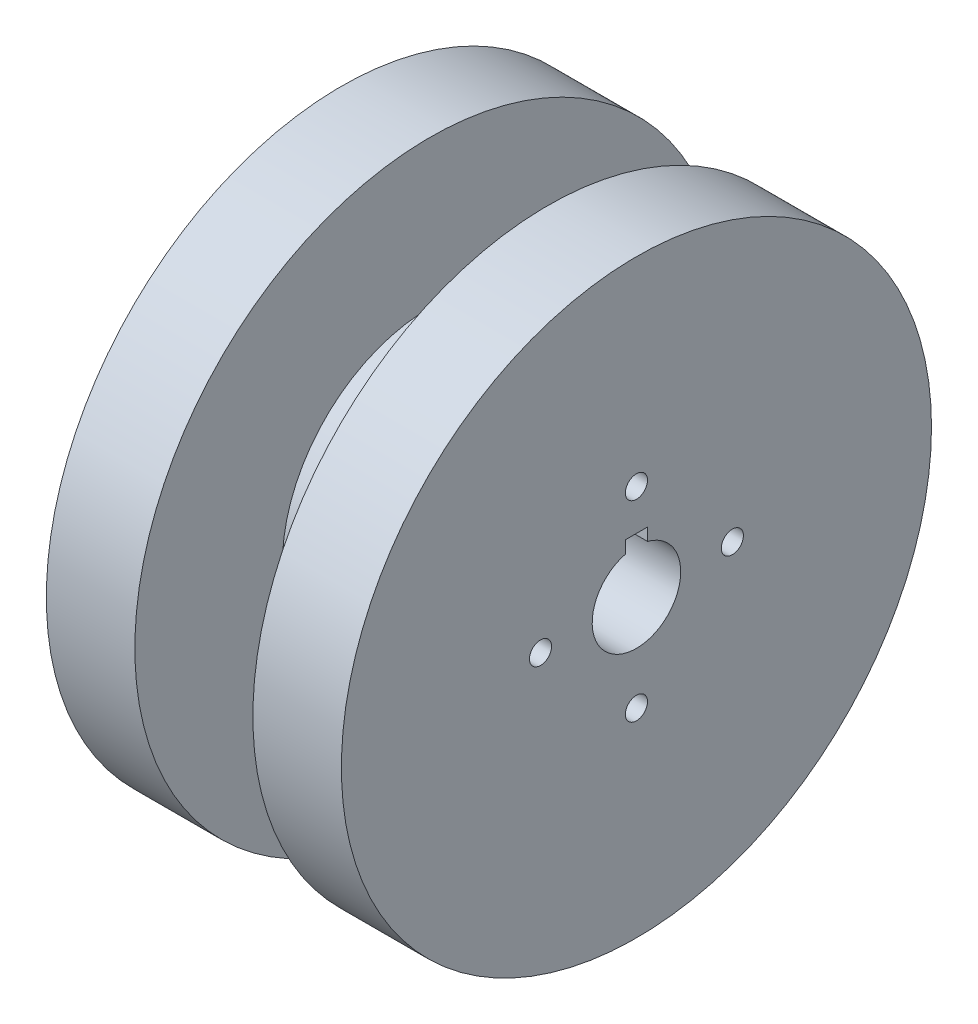
ISO-10303-21;
HEADER;
FILE_DESCRIPTION(('STEP AP214'),'2;1');
FILE_NAME('part.step','',(''),(''),'','','');
FILE_SCHEMA(('AUTOMOTIVE_DESIGN { 1 0 10303 214 1 1 1 1 }'));
ENDSEC;
DATA;
#1=APPLICATION_CONTEXT('core data for automotive mechanical design processes');
#2=APPLICATION_PROTOCOL_DEFINITION('international standard','automotive_design',2000,#1);
#3=PRODUCT_CONTEXT('',#1,'mechanical');
#4=PRODUCT('Part','Part','',(#3));
#5=PRODUCT_RELATED_PRODUCT_CATEGORY('part','',(#4));
#6=PRODUCT_DEFINITION_FORMATION('','',#4);
#7=PRODUCT_DEFINITION_CONTEXT('part definition',#1,'design');
#8=PRODUCT_DEFINITION('design','',#6,#7);
#9=PRODUCT_DEFINITION_SHAPE('','',#8);
#10=(LENGTH_UNIT() NAMED_UNIT(*) SI_UNIT(.MILLI.,.METRE.));
#11=(NAMED_UNIT(*) PLANE_ANGLE_UNIT() SI_UNIT($,.RADIAN.));
#12=(NAMED_UNIT(*) SI_UNIT($,.STERADIAN.) SOLID_ANGLE_UNIT());
#13=UNCERTAINTY_MEASURE_WITH_UNIT(LENGTH_MEASURE(1.E-05),#10,'distance_accuracy_value','');
#14=(GEOMETRIC_REPRESENTATION_CONTEXT(3) GLOBAL_UNCERTAINTY_ASSIGNED_CONTEXT((#13)) GLOBAL_UNIT_ASSIGNED_CONTEXT((#10,
#11,#12)) REPRESENTATION_CONTEXT('',''));
#15=CARTESIAN_POINT('',(0.,0.,0.));
#16=DIRECTION('',(0.,0.,1.));
#17=DIRECTION('',(1.,0.,0.));
#18=AXIS2_PLACEMENT_3D('',#15,#16,#17);
#19=CARTESIAN_POINT('',(40.,0.,0.));
#20=DIRECTION('',(-1.,0.,0.));
#21=DIRECTION('',(0.,0.,1.));
#22=AXIS2_PLACEMENT_3D('',#19,#20,#21);
#23=CYLINDRICAL_SURFACE('',#22,6.);
#24=CARTESIAN_POINT('',(4.,0.,0.));
#25=DIRECTION('',(-1.,0.,0.));
#26=DIRECTION('',(0.,0.,1.));
#27=AXIS2_PLACEMENT_3D('',#24,#25,#26);
#28=CIRCLE('',#27,6.);
#29=CARTESIAN_POINT('',(4.,5.80947501931113,1.5));
#30=VERTEX_POINT('',#29);
#31=CARTESIAN_POINT('',(4.,5.80947501931113,-1.5));
#32=VERTEX_POINT('',#31);
#33=EDGE_CURVE('E296',#30,#32,#28,.F.);
#34=ORIENTED_EDGE('',*,*,#33,.F.);
#35=DIRECTION('',(-1.,0.,0.));
#36=VECTOR('',#35,1.);
#37=CARTESIAN_POINT('',(40.,5.80947501931113,1.5));
#38=LINE('',#37,#36);
#39=CARTESIAN_POINT('',(40.,5.80947501931113,1.5));
#40=VERTEX_POINT('',#39);
#41=EDGE_CURVE('E321',#40,#30,#38,.T.);
#42=ORIENTED_EDGE('',*,*,#41,.F.);
#43=CARTESIAN_POINT('',(40.,0.,0.));
#44=DIRECTION('',(-1.,0.,0.));
#45=DIRECTION('',(0.,0.,1.));
#46=AXIS2_PLACEMENT_3D('',#43,#44,#45);
#47=CIRCLE('',#46,6.);
#48=CARTESIAN_POINT('',(40.,5.80947501931113,-1.5));
#49=VERTEX_POINT('',#48);
#50=EDGE_CURVE('E302',#49,#40,#47,.T.);
#51=ORIENTED_EDGE('',*,*,#50,.F.);
#52=DIRECTION('',(-1.,0.,0.));
#53=VECTOR('',#52,1.);
#54=CARTESIAN_POINT('',(40.,5.80947501931113,-1.5));
#55=LINE('',#54,#53);
#56=EDGE_CURVE('E322',#49,#32,#55,.T.);
#57=ORIENTED_EDGE('',*,*,#56,.T.);
#58=EDGE_LOOP('',(#34,#42,#51,#57));
#59=FACE_BOUND('',#58,.T.);
#60=ADVANCED_FACE('F37',(#59),#23,.F.);
#61=CARTESIAN_POINT('',(40.,0.,-1.5));
#62=DIRECTION('',(0.,0.,-1.));
#63=DIRECTION('',(-1.,0.,0.));
#64=AXIS2_PLACEMENT_3D('',#61,#62,#63);
#65=PLANE('',#64);
#66=DIRECTION('',(0.,1.,0.));
#67=VECTOR('',#66,1.);
#68=CARTESIAN_POINT('',(4.,0.,-1.5));
#69=LINE('',#68,#67);
#70=CARTESIAN_POINT('',(4.,7.5,-1.5));
#71=VERTEX_POINT('',#70);
#72=EDGE_CURVE('E294',#32,#71,#69,.T.);
#73=ORIENTED_EDGE('',*,*,#72,.F.);
#74=ORIENTED_EDGE('',*,*,#56,.F.);
#75=DIRECTION('',(0.,-1.,0.));
#76=VECTOR('',#75,1.);
#77=CARTESIAN_POINT('',(40.,0.,-1.5));
#78=LINE('',#77,#76);
#79=CARTESIAN_POINT('',(40.,7.5,-1.5));
#80=VERTEX_POINT('',#79);
#81=EDGE_CURVE('E318',#80,#49,#78,.T.);
#82=ORIENTED_EDGE('',*,*,#81,.F.);
#83=DIRECTION('',(-1.,0.,0.));
#84=VECTOR('',#83,1.);
#85=CARTESIAN_POINT('',(40.,7.5,-1.5));
#86=LINE('',#85,#84);
#87=EDGE_CURVE('E326',#80,#71,#86,.T.);
#88=ORIENTED_EDGE('',*,*,#87,.T.);
#89=EDGE_LOOP('',(#73,#74,#82,#88));
#90=FACE_BOUND('',#89,.T.);
#91=ADVANCED_FACE('F411',(#90),#65,.F.);
#92=CARTESIAN_POINT('',(40.,7.5,0.));
#93=DIRECTION('',(0.,-1.,0.));
#94=DIRECTION('',(0.,0.,-1.));
#95=AXIS2_PLACEMENT_3D('',#92,#93,#94);
#96=PLANE('',#95);
#97=DIRECTION('',(-1.,0.,0.));
#98=VECTOR('',#97,1.);
#99=CARTESIAN_POINT('',(40.,7.5,1.5));
#100=LINE('',#99,#98);
#101=CARTESIAN_POINT('',(40.,7.5,1.5));
#102=VERTEX_POINT('',#101);
#103=CARTESIAN_POINT('',(4.,7.5,1.5));
#104=VERTEX_POINT('',#103);
#105=EDGE_CURVE('E329',#102,#104,#100,.T.);
#106=ORIENTED_EDGE('',*,*,#105,.T.);
#107=DIRECTION('',(0.,0.,-1.));
#108=VECTOR('',#107,1.);
#109=CARTESIAN_POINT('',(4.,7.5,0.));
#110=LINE('',#109,#108);
#111=EDGE_CURVE('E291',#104,#71,#110,.T.);
#112=ORIENTED_EDGE('',*,*,#111,.T.);
#113=ORIENTED_EDGE('',*,*,#87,.F.);
#114=DIRECTION('',(0.,0.,1.));
#115=VECTOR('',#114,1.);
#116=CARTESIAN_POINT('',(40.,7.5,0.));
#117=LINE('',#116,#115);
#118=EDGE_CURVE('E315',#80,#102,#117,.T.);
#119=ORIENTED_EDGE('',*,*,#118,.T.);
#120=EDGE_LOOP('',(#106,#112,#113,#119));
#121=FACE_BOUND('',#120,.T.);
#122=ADVANCED_FACE('F417',(#121),#96,.T.);
#123=CARTESIAN_POINT('',(40.,0.,1.5));
#124=DIRECTION('',(0.,0.,-1.));
#125=DIRECTION('',(-1.,0.,0.));
#126=AXIS2_PLACEMENT_3D('',#123,#124,#125);
#127=PLANE('',#126);
#128=ORIENTED_EDGE('',*,*,#41,.T.);
#129=DIRECTION('',(0.,1.,0.));
#130=VECTOR('',#129,1.);
#131=CARTESIAN_POINT('',(4.,0.,1.5));
#132=LINE('',#131,#130);
#133=EDGE_CURVE('E288',#30,#104,#132,.T.);
#134=ORIENTED_EDGE('',*,*,#133,.T.);
#135=ORIENTED_EDGE('',*,*,#105,.F.);
#136=DIRECTION('',(0.,-1.,0.));
#137=VECTOR('',#136,1.);
#138=CARTESIAN_POINT('',(40.,0.,1.5));
#139=LINE('',#138,#137);
#140=EDGE_CURVE('E313',#102,#40,#139,.T.);
#141=ORIENTED_EDGE('',*,*,#140,.T.);
#142=EDGE_LOOP('',(#128,#134,#135,#141));
#143=FACE_BOUND('',#142,.T.);
#144=ADVANCED_FACE('F423',(#143),#127,.T.);
#145=CARTESIAN_POINT('',(40.,0.,-13.001726509014));
#146=DIRECTION('',(-1.,0.,0.));
#147=DIRECTION('',(0.,0.,1.));
#148=AXIS2_PLACEMENT_3D('',#145,#146,#147);
#149=CYLINDRICAL_SURFACE('',#148,1.5);
#150=CARTESIAN_POINT('',(40.,0.,-13.001726509014));
#151=DIRECTION('',(-1.,0.,0.));
#152=DIRECTION('',(0.,0.,1.));
#153=AXIS2_PLACEMENT_3D('',#150,#151,#152);
#154=CIRCLE('',#153,1.5);
#155=CARTESIAN_POINT('',(40.,0.,-11.501726509014));
#156=VERTEX_POINT('',#155);
#157=EDGE_CURVE('E298',#156,#156,#154,.T.);
#158=ORIENTED_EDGE('',*,*,#157,.F.);
#159=EDGE_LOOP('',(#158));
#160=FACE_BOUND('',#159,.T.);
#161=CARTESIAN_POINT('',(4.,0.,-13.001726509014));
#162=DIRECTION('',(-1.,0.,0.));
#163=DIRECTION('',(0.,0.,1.));
#164=AXIS2_PLACEMENT_3D('',#161,#162,#163);
#165=CIRCLE('',#164,1.5);
#166=CARTESIAN_POINT('',(4.,0.,-11.501726509014));
#167=VERTEX_POINT('',#166);
#168=EDGE_CURVE('E285',#167,#167,#165,.F.);
#169=ORIENTED_EDGE('',*,*,#168,.F.);
#170=EDGE_LOOP('',(#169));
#171=FACE_BOUND('',#170,.T.);
#172=ADVANCED_FACE('F483',(#160,#171),#149,.F.);
#173=CARTESIAN_POINT('',(40.,-13.001726509014,1.36185856436893E-13));
#174=DIRECTION('',(-1.,0.,0.));
#175=DIRECTION('',(0.,0.,1.));
#176=AXIS2_PLACEMENT_3D('',#173,#174,#175);
#177=CYLINDRICAL_SURFACE('',#176,1.5);
#178=CARTESIAN_POINT('',(40.,-13.001726509014,1.36185856436893E-13));
#179=DIRECTION('',(-1.,0.,0.));
#180=DIRECTION('',(0.,0.,1.));
#181=AXIS2_PLACEMENT_3D('',#178,#179,#180);
#182=CIRCLE('',#181,1.5);
#183=CARTESIAN_POINT('',(40.,-13.001726509014,1.50000000000014));
#184=VERTEX_POINT('',#183);
#185=EDGE_CURVE('E306',#184,#184,#182,.T.);
#186=ORIENTED_EDGE('',*,*,#185,.F.);
#187=EDGE_LOOP('',(#186));
#188=FACE_BOUND('',#187,.T.);
#189=CARTESIAN_POINT('',(4.,-13.001726509014,1.36185856436893E-13));
#190=DIRECTION('',(-1.,0.,0.));
#191=DIRECTION('',(0.,0.,1.));
#192=AXIS2_PLACEMENT_3D('',#189,#190,#191);
#193=CIRCLE('',#192,1.5);
#194=CARTESIAN_POINT('',(4.,-13.001726509014,1.50000000000014));
#195=VERTEX_POINT('',#194);
#196=EDGE_CURVE('E282',#195,#195,#193,.F.);
#197=ORIENTED_EDGE('',*,*,#196,.F.);
#198=EDGE_LOOP('',(#197));
#199=FACE_BOUND('',#198,.T.);
#200=ADVANCED_FACE('F472',(#188,#199),#177,.F.);
#201=CARTESIAN_POINT('',(40.,0.,13.001726509014));
#202=DIRECTION('',(-1.,0.,0.));
#203=DIRECTION('',(0.,0.,1.));
#204=AXIS2_PLACEMENT_3D('',#201,#202,#203);
#205=CYLINDRICAL_SURFACE('',#204,1.5);
#206=CARTESIAN_POINT('',(40.,0.,13.001726509014));
#207=DIRECTION('',(-1.,0.,0.));
#208=DIRECTION('',(0.,0.,1.));
#209=AXIS2_PLACEMENT_3D('',#206,#207,#208);
#210=CIRCLE('',#209,1.5);
#211=CARTESIAN_POINT('',(40.,0.,14.501726509014));
#212=VERTEX_POINT('',#211);
#213=EDGE_CURVE('E303',#212,#212,#210,.T.);
#214=ORIENTED_EDGE('',*,*,#213,.F.);
#215=EDGE_LOOP('',(#214));
#216=FACE_BOUND('',#215,.T.);
#217=CARTESIAN_POINT('',(4.,0.,13.001726509014));
#218=DIRECTION('',(-1.,0.,0.));
#219=DIRECTION('',(0.,0.,1.));
#220=AXIS2_PLACEMENT_3D('',#217,#218,#219);
#221=CIRCLE('',#220,1.5);
#222=CARTESIAN_POINT('',(4.,0.,14.501726509014));
#223=VERTEX_POINT('',#222);
#224=EDGE_CURVE('E279',#223,#223,#221,.F.);
#225=ORIENTED_EDGE('',*,*,#224,.F.);
#226=EDGE_LOOP('',(#225));
#227=FACE_BOUND('',#226,.T.);
#228=ADVANCED_FACE('F466',(#216,#227),#205,.F.);
#229=CARTESIAN_POINT('',(40.,13.001726509014,0.));
#230=DIRECTION('',(-1.,0.,0.));
#231=DIRECTION('',(0.,0.,1.));
#232=AXIS2_PLACEMENT_3D('',#229,#230,#231);
#233=CYLINDRICAL_SURFACE('',#232,1.5);
#234=CARTESIAN_POINT('',(40.,13.001726509014,0.));
#235=DIRECTION('',(-1.,0.,0.));
#236=DIRECTION('',(0.,0.,1.));
#237=AXIS2_PLACEMENT_3D('',#234,#235,#236);
#238=CIRCLE('',#237,1.5);
#239=CARTESIAN_POINT('',(40.,13.001726509014,1.49999999999995));
#240=VERTEX_POINT('',#239);
#241=EDGE_CURVE('E299',#240,#240,#238,.T.);
#242=ORIENTED_EDGE('',*,*,#241,.F.);
#243=EDGE_LOOP('',(#242));
#244=FACE_BOUND('',#243,.T.);
#245=CARTESIAN_POINT('',(4.,13.001726509014,0.));
#246=DIRECTION('',(-1.,0.,0.));
#247=DIRECTION('',(0.,0.,1.));
#248=AXIS2_PLACEMENT_3D('',#245,#246,#247);
#249=CIRCLE('',#248,1.5);
#250=CARTESIAN_POINT('',(4.,13.001726509014,1.49999999999995));
#251=VERTEX_POINT('',#250);
#252=EDGE_CURVE('E270',#251,#251,#249,.F.);
#253=ORIENTED_EDGE('',*,*,#252,.F.);
#254=EDGE_LOOP('',(#253));
#255=FACE_BOUND('',#254,.T.);
#256=ADVANCED_FACE('F450',(#244,#255),#233,.F.);
#257=CARTESIAN_POINT('',(0.,0.,0.));
#258=DIRECTION('',(-1.,0.,0.));
#259=DIRECTION('',(0.,0.,1.));
#260=AXIS2_PLACEMENT_3D('',#257,#258,#259);
#261=PLANE('',#260);
#262=DIRECTION('',(0.,1.,0.));
#263=VECTOR('',#262,1.);
#264=CARTESIAN_POINT('',(0.,-25.1234705355057,25.1234705355057));
#265=LINE('',#264,#263);
#266=CARTESIAN_POINT('',(0.,-25.1234705355057,25.1234705355057));
#267=VERTEX_POINT('',#266);
#268=CARTESIAN_POINT('',(0.,-7.72169027594545,25.1234705355055));
#269=VERTEX_POINT('',#268);
#270=EDGE_CURVE('E204',#267,#269,#265,.T.);
#271=ORIENTED_EDGE('',*,*,#270,.F.);
#272=DIRECTION('',(0.,0.,1.));
#273=VECTOR('',#272,1.);
#274=CARTESIAN_POINT('',(0.,-25.1234705355057,-25.1234705355057));
#275=LINE('',#274,#273);
#276=CARTESIAN_POINT('',(0.,-25.1234705355057,7.72169027594537));
#277=VERTEX_POINT('',#276);
#278=EDGE_CURVE('E212',#277,#267,#275,.T.);
#279=ORIENTED_EDGE('',*,*,#278,.F.);
#280=DIRECTION('',(0.,0.707106781186549,0.707106781186546));
#281=VECTOR('',#280,1.);
#282=CARTESIAN_POINT('',(0.,-32.8451608114511,0.));
#283=LINE('',#282,#281);
#284=CARTESIAN_POINT('',(0.,-32.8451608114511,0.));
#285=VERTEX_POINT('',#284);
#286=EDGE_CURVE('E257',#285,#277,#283,.T.);
#287=ORIENTED_EDGE('',*,*,#286,.F.);
#288=DIRECTION('',(0.,-0.707106781186544,0.707106781186551));
#289=VECTOR('',#288,1.);
#290=CARTESIAN_POINT('',(0.,-3.4403479813345E-13,-32.8451608114511));
#291=LINE('',#290,#289);
#292=CARTESIAN_POINT('',(0.,-25.1234705355057,-7.72169027594547));
#293=VERTEX_POINT('',#292);
#294=EDGE_CURVE('E238',#293,#285,#291,.T.);
#295=ORIENTED_EDGE('',*,*,#294,.F.);
#296=CARTESIAN_POINT('',(0.,-25.1234705355057,-25.1234705355057));
#297=VERTEX_POINT('',#296);
#298=EDGE_CURVE('E184',#297,#293,#275,.T.);
#299=ORIENTED_EDGE('',*,*,#298,.F.);
#300=DIRECTION('',(0.,-1.,0.));
#301=VECTOR('',#300,1.);
#302=CARTESIAN_POINT('',(0.,25.1234705355052,-25.1234705355055));
#303=LINE('',#302,#301);
#304=CARTESIAN_POINT('',(0.,-7.72169027594572,-25.1234705355056));
#305=VERTEX_POINT('',#304);
#306=EDGE_CURVE('E209',#305,#297,#303,.T.);
#307=ORIENTED_EDGE('',*,*,#306,.F.);
#308=CARTESIAN_POINT('',(0.,-3.4403479813345E-13,-32.8451608114511));
#309=VERTEX_POINT('',#308);
#310=EDGE_CURVE('E253',#309,#305,#291,.T.);
#311=ORIENTED_EDGE('',*,*,#310,.F.);
#312=DIRECTION('',(0.,-0.707106781186554,-0.707106781186541));
#313=VECTOR('',#312,1.);
#314=CARTESIAN_POINT('',(0.,32.8451608114511,-2.29356532088966E-13));
#315=LINE('',#314,#313);
#316=CARTESIAN_POINT('',(0.,7.72169027594528,-25.1234705355056));
#317=VERTEX_POINT('',#316);
#318=EDGE_CURVE('E264',#317,#309,#315,.T.);
#319=ORIENTED_EDGE('',*,*,#318,.F.);
#320=CARTESIAN_POINT('',(0.,25.1234705355052,-25.1234705355055));
#321=VERTEX_POINT('',#320);
#322=EDGE_CURVE('E210',#321,#317,#303,.T.);
#323=ORIENTED_EDGE('',*,*,#322,.F.);
#324=DIRECTION('',(0.,0.,-1.));
#325=VECTOR('',#324,1.);
#326=CARTESIAN_POINT('',(0.,25.1234705355054,25.1234705355053));
#327=LINE('',#326,#325);
#328=CARTESIAN_POINT('',(0.,25.1234705355053,-7.72169027594589));
#329=VERTEX_POINT('',#328);
#330=EDGE_CURVE('E206',#329,#321,#327,.T.);
#331=ORIENTED_EDGE('',*,*,#330,.F.);
#332=CARTESIAN_POINT('',(0.,32.8451608114511,-2.29356532088966E-13));
#333=VERTEX_POINT('',#332);
#334=EDGE_CURVE('E243',#333,#329,#315,.T.);
#335=ORIENTED_EDGE('',*,*,#334,.F.);
#336=DIRECTION('',(0.,0.707106781186544,-0.707106781186551));
#337=VECTOR('',#336,1.);
#338=CARTESIAN_POINT('',(0.,1.14678266044483E-13,32.8451608114511));
#339=LINE('',#338,#337);
#340=CARTESIAN_POINT('',(0.,25.1234705355053,7.72169027594559));
#341=VERTEX_POINT('',#340);
#342=EDGE_CURVE('E260',#341,#333,#339,.T.);
#343=ORIENTED_EDGE('',*,*,#342,.F.);
#344=CARTESIAN_POINT('',(0.,25.1234705355054,25.1234705355053));
#345=VERTEX_POINT('',#344);
#346=EDGE_CURVE('E207',#345,#341,#327,.T.);
#347=ORIENTED_EDGE('',*,*,#346,.F.);
#348=CARTESIAN_POINT('',(0.,7.7216902759457,25.1234705355054));
#349=VERTEX_POINT('',#348);
#350=EDGE_CURVE('E190',#349,#345,#265,.T.);
#351=ORIENTED_EDGE('',*,*,#350,.F.);
#352=CARTESIAN_POINT('',(0.,1.14678266044483E-13,32.8451608114511));
#353=VERTEX_POINT('',#352);
#354=EDGE_CURVE('E261',#353,#349,#339,.T.);
#355=ORIENTED_EDGE('',*,*,#354,.F.);
#356=EDGE_CURVE('E256',#269,#353,#283,.T.);
#357=ORIENTED_EDGE('',*,*,#356,.F.);
#358=EDGE_LOOP('',(#271,#279,#287,#295,#299,#307,#311,#319,#323,#331,#335,#343,#347,#351,#355,#357));
#359=FACE_BOUND('',#358,.T.);
#360=CARTESIAN_POINT('',(0.,0.,0.));
#361=DIRECTION('',(1.,0.,0.));
#362=DIRECTION('',(0.,0.,-1.));
#363=AXIS2_PLACEMENT_3D('',#360,#361,#362);
#364=CIRCLE('',#363,40.);
#365=CARTESIAN_POINT('',(0.,0.,-40.));
#366=VERTEX_POINT('',#365);
#367=EDGE_CURVE('E348',#366,#366,#364,.T.);
#368=ORIENTED_EDGE('',*,*,#367,.F.);
#369=EDGE_LOOP('',(#368));
#370=FACE_BOUND('',#369,.T.);
#371=ADVANCED_FACE('F39',(#359,#370),#261,.T.);
#372=CARTESIAN_POINT('',(40.,0.,0.));
#373=DIRECTION('',(1.,0.,0.));
#374=DIRECTION('',(0.,0.,-1.));
#375=AXIS2_PLACEMENT_3D('',#372,#373,#374);
#376=CYLINDRICAL_SURFACE('',#375,40.);
#377=ORIENTED_EDGE('',*,*,#367,.T.);
#378=EDGE_LOOP('',(#377));
#379=FACE_BOUND('',#378,.T.);
#380=CARTESIAN_POINT('',(12.,0.,0.));
#381=DIRECTION('',(1.,0.,0.));
#382=DIRECTION('',(0.,0.,-1.));
#383=AXIS2_PLACEMENT_3D('',#380,#381,#382);
#384=CIRCLE('',#383,40.);
#385=CARTESIAN_POINT('',(12.,0.,-40.));
#386=VERTEX_POINT('',#385);
#387=EDGE_CURVE('E345',#386,#386,#384,.T.);
#388=ORIENTED_EDGE('',*,*,#387,.F.);
#389=EDGE_LOOP('',(#388));
#390=FACE_BOUND('',#389,.T.);
#391=ADVANCED_FACE('F443',(#379,#390),#376,.T.);
#392=CARTESIAN_POINT('',(12.,40.,0.));
#393=DIRECTION('',(1.,0.,0.));
#394=DIRECTION('',(0.,0.,-1.));
#395=AXIS2_PLACEMENT_3D('',#392,#393,#394);
#396=PLANE('',#395);
#397=ORIENTED_EDGE('',*,*,#387,.T.);
#398=EDGE_LOOP('',(#397));
#399=FACE_BOUND('',#398,.T.);
#400=CARTESIAN_POINT('',(12.,0.,0.));
#401=DIRECTION('',(1.,0.,0.));
#402=DIRECTION('',(0.,0.,-1.));
#403=AXIS2_PLACEMENT_3D('',#400,#401,#402);
#404=CIRCLE('',#403,20.);
#405=CARTESIAN_POINT('',(12.,0.,-20.));
#406=VERTEX_POINT('',#405);
#407=EDGE_CURVE('E342',#406,#406,#404,.T.);
#408=ORIENTED_EDGE('',*,*,#407,.F.);
#409=EDGE_LOOP('',(#408));
#410=FACE_BOUND('',#409,.T.);
#411=ADVANCED_FACE('F440',(#399,#410),#396,.T.);
#412=CARTESIAN_POINT('',(40.,0.,0.));
#413=DIRECTION('',(1.,0.,0.));
#414=DIRECTION('',(0.,0.,-1.));
#415=AXIS2_PLACEMENT_3D('',#412,#413,#414);
#416=CYLINDRICAL_SURFACE('',#415,20.);
#417=ORIENTED_EDGE('',*,*,#407,.T.);
#418=EDGE_LOOP('',(#417));
#419=FACE_BOUND('',#418,.T.);
#420=CARTESIAN_POINT('',(28.,0.,0.));
#421=DIRECTION('',(1.,0.,0.));
#422=DIRECTION('',(0.,0.,-1.));
#423=AXIS2_PLACEMENT_3D('',#420,#421,#422);
#424=CIRCLE('',#423,20.);
#425=CARTESIAN_POINT('',(28.,0.,-20.));
#426=VERTEX_POINT('',#425);
#427=EDGE_CURVE('E339',#426,#426,#424,.T.);
#428=ORIENTED_EDGE('',*,*,#427,.F.);
#429=EDGE_LOOP('',(#428));
#430=FACE_BOUND('',#429,.T.);
#431=ADVANCED_FACE('F436',(#419,#430),#416,.T.);
#432=CARTESIAN_POINT('',(28.,20.,0.));
#433=DIRECTION('',(-1.,0.,0.));
#434=DIRECTION('',(0.,0.,1.));
#435=AXIS2_PLACEMENT_3D('',#432,#433,#434);
#436=PLANE('',#435);
#437=ORIENTED_EDGE('',*,*,#427,.T.);
#438=EDGE_LOOP('',(#437));
#439=FACE_BOUND('',#438,.T.);
#440=CARTESIAN_POINT('',(28.,0.,0.));
#441=DIRECTION('',(1.,0.,0.));
#442=DIRECTION('',(0.,0.,-1.));
#443=AXIS2_PLACEMENT_3D('',#440,#441,#442);
#444=CIRCLE('',#443,40.);
#445=CARTESIAN_POINT('',(28.,0.,-40.));
#446=VERTEX_POINT('',#445);
#447=EDGE_CURVE('E336',#446,#446,#444,.T.);
#448=ORIENTED_EDGE('',*,*,#447,.F.);
#449=EDGE_LOOP('',(#448));
#450=FACE_BOUND('',#449,.T.);
#451=ADVANCED_FACE('F432',(#439,#450),#436,.T.);
#452=CARTESIAN_POINT('',(40.,0.,0.));
#453=DIRECTION('',(1.,0.,0.));
#454=DIRECTION('',(0.,0.,-1.));
#455=AXIS2_PLACEMENT_3D('',#452,#453,#454);
#456=CYLINDRICAL_SURFACE('',#455,40.);
#457=ORIENTED_EDGE('',*,*,#447,.T.);
#458=EDGE_LOOP('',(#457));
#459=FACE_BOUND('',#458,.T.);
#460=CARTESIAN_POINT('',(40.,0.,0.));
#461=DIRECTION('',(1.,0.,0.));
#462=DIRECTION('',(0.,0.,-1.));
#463=AXIS2_PLACEMENT_3D('',#460,#461,#462);
#464=CIRCLE('',#463,40.);
#465=CARTESIAN_POINT('',(40.,0.,-40.));
#466=VERTEX_POINT('',#465);
#467=EDGE_CURVE('E325',#466,#466,#464,.T.);
#468=ORIENTED_EDGE('',*,*,#467,.F.);
#469=EDGE_LOOP('',(#468));
#470=FACE_BOUND('',#469,.T.);
#471=ADVANCED_FACE('F428',(#459,#470),#456,.T.);
#472=CARTESIAN_POINT('',(40.,40.,0.));
#473=DIRECTION('',(1.,0.,0.));
#474=DIRECTION('',(0.,0.,-1.));
#475=AXIS2_PLACEMENT_3D('',#472,#473,#474);
#476=PLANE('',#475);
#477=ORIENTED_EDGE('',*,*,#241,.T.);
#478=EDGE_LOOP('',(#477));
#479=FACE_BOUND('',#478,.T.);
#480=ORIENTED_EDGE('',*,*,#213,.T.);
#481=EDGE_LOOP('',(#480));
#482=FACE_BOUND('',#481,.T.);
#483=ORIENTED_EDGE('',*,*,#185,.T.);
#484=EDGE_LOOP('',(#483));
#485=FACE_BOUND('',#484,.T.);
#486=ORIENTED_EDGE('',*,*,#157,.T.);
#487=EDGE_LOOP('',(#486));
#488=FACE_BOUND('',#487,.T.);
#489=ORIENTED_EDGE('',*,*,#50,.T.);
#490=ORIENTED_EDGE('',*,*,#140,.F.);
#491=ORIENTED_EDGE('',*,*,#118,.F.);
#492=ORIENTED_EDGE('',*,*,#81,.T.);
#493=EDGE_LOOP('',(#489,#490,#491,#492));
#494=FACE_BOUND('',#493,.T.);
#495=ORIENTED_EDGE('',*,*,#467,.T.);
#496=EDGE_LOOP('',(#495));
#497=FACE_BOUND('',#496,.T.);
#498=ADVANCED_FACE('F425',(#479,#482,#485,#488,#494,#497),#476,.T.);
#499=CARTESIAN_POINT('',(4.,0.,0.));
#500=DIRECTION('',(-1.,0.,0.));
#501=DIRECTION('',(0.,0.,1.));
#502=AXIS2_PLACEMENT_3D('',#499,#500,#501);
#503=PLANE('',#502);
#504=ORIENTED_EDGE('',*,*,#168,.T.);
#505=EDGE_LOOP('',(#504));
#506=FACE_BOUND('',#505,.T.);
#507=ORIENTED_EDGE('',*,*,#196,.T.);
#508=EDGE_LOOP('',(#507));
#509=FACE_BOUND('',#508,.T.);
#510=ORIENTED_EDGE('',*,*,#224,.T.);
#511=EDGE_LOOP('',(#510));
#512=FACE_BOUND('',#511,.T.);
#513=ORIENTED_EDGE('',*,*,#252,.T.);
#514=EDGE_LOOP('',(#513));
#515=FACE_BOUND('',#514,.T.);
#516=DIRECTION('',(0.,-0.707106781186544,0.707106781186551));
#517=VECTOR('',#516,1.);
#518=CARTESIAN_POINT('',(4.,-3.4403479813345E-13,-32.8451608114511));
#519=LINE('',#518,#517);
#520=CARTESIAN_POINT('',(4.,-3.4403479813345E-13,-32.8451608114511));
#521=VERTEX_POINT('',#520);
#522=CARTESIAN_POINT('',(4.,-32.8451608114511,0.));
#523=VERTEX_POINT('',#522);
#524=EDGE_CURVE('E239',#521,#523,#519,.T.);
#525=ORIENTED_EDGE('',*,*,#524,.T.);
#526=DIRECTION('',(0.,0.707106781186549,0.707106781186546));
#527=VECTOR('',#526,1.);
#528=CARTESIAN_POINT('',(4.,-32.8451608114511,0.));
#529=LINE('',#528,#527);
#530=CARTESIAN_POINT('',(4.,1.14678266044483E-13,32.8451608114511));
#531=VERTEX_POINT('',#530);
#532=EDGE_CURVE('E242',#523,#531,#529,.T.);
#533=ORIENTED_EDGE('',*,*,#532,.T.);
#534=DIRECTION('',(0.,0.707106781186544,-0.707106781186551));
#535=VECTOR('',#534,1.);
#536=CARTESIAN_POINT('',(4.,1.14678266044483E-13,32.8451608114511));
#537=LINE('',#536,#535);
#538=CARTESIAN_POINT('',(4.,32.8451608114511,-2.29356532088966E-13));
#539=VERTEX_POINT('',#538);
#540=EDGE_CURVE('E246',#531,#539,#537,.T.);
#541=ORIENTED_EDGE('',*,*,#540,.T.);
#542=DIRECTION('',(0.,-0.707106781186554,-0.707106781186541));
#543=VECTOR('',#542,1.);
#544=CARTESIAN_POINT('',(4.,32.8451608114511,-2.29356532088966E-13));
#545=LINE('',#544,#543);
#546=EDGE_CURVE('E249',#539,#521,#545,.T.);
#547=ORIENTED_EDGE('',*,*,#546,.T.);
#548=EDGE_LOOP('',(#525,#533,#541,#547));
#549=FACE_BOUND('',#548,.T.);
#550=ORIENTED_EDGE('',*,*,#33,.T.);
#551=ORIENTED_EDGE('',*,*,#72,.T.);
#552=ORIENTED_EDGE('',*,*,#111,.F.);
#553=ORIENTED_EDGE('',*,*,#133,.F.);
#554=EDGE_LOOP('',(#550,#551,#552,#553));
#555=FACE_BOUND('',#554,.T.);
#556=ADVANCED_FACE('F375',(#506,#509,#512,#515,#549,#555),#503,.T.);
#557=CARTESIAN_POINT('',(4.,-3.4403479813345E-13,-32.8451608114511));
#558=DIRECTION('',(0.,-0.707106781186551,-0.707106781186544));
#559=DIRECTION('',(0.,0.707106781186544,-0.707106781186551));
#560=AXIS2_PLACEMENT_3D('',#557,#558,#559);
#561=PLANE('',#560);
#562=DIRECTION('',(0.,0.707106781186544,-0.707106781186551));
#563=VECTOR('',#562,1.);
#564=CARTESIAN_POINT('',(3.,-3.4403479813345E-13,-32.8451608114511));
#565=LINE('',#564,#563);
#566=CARTESIAN_POINT('',(3.,-25.1234705355057,-7.72169027594547));
#567=VERTEX_POINT('',#566);
#568=CARTESIAN_POINT('',(3.,-7.72169027594572,-25.1234705355056));
#569=VERTEX_POINT('',#568);
#570=EDGE_CURVE('E225',#567,#569,#565,.T.);
#571=ORIENTED_EDGE('',*,*,#570,.F.);
#572=DIRECTION('',(-1.,0.,0.));
#573=VECTOR('',#572,1.);
#574=CARTESIAN_POINT('',(4.,-25.1234705355057,-7.72169027594547));
#575=LINE('',#574,#573);
#576=EDGE_CURVE('E227',#567,#293,#575,.T.);
#577=ORIENTED_EDGE('',*,*,#576,.T.);
#578=ORIENTED_EDGE('',*,*,#294,.T.);
#579=DIRECTION('',(-1.,0.,0.));
#580=VECTOR('',#579,1.);
#581=CARTESIAN_POINT('',(4.,-32.8451608114511,0.));
#582=LINE('',#581,#580);
#583=EDGE_CURVE('E252',#523,#285,#582,.T.);
#584=ORIENTED_EDGE('',*,*,#583,.F.);
#585=ORIENTED_EDGE('',*,*,#524,.F.);
#586=DIRECTION('',(-1.,0.,0.));
#587=VECTOR('',#586,1.);
#588=CARTESIAN_POINT('',(4.,-3.4403479813345E-13,-32.8451608114511));
#589=LINE('',#588,#587);
#590=EDGE_CURVE('E267',#521,#309,#589,.T.);
#591=ORIENTED_EDGE('',*,*,#590,.T.);
#592=ORIENTED_EDGE('',*,*,#310,.T.);
#593=DIRECTION('',(1.,0.,0.));
#594=VECTOR('',#593,1.);
#595=CARTESIAN_POINT('',(4.,-7.72169027594572,-25.1234705355056));
#596=LINE('',#595,#594);
#597=EDGE_CURVE('E235',#305,#569,#596,.T.);
#598=ORIENTED_EDGE('',*,*,#597,.T.);
#599=EDGE_LOOP('',(#571,#577,#578,#584,#585,#591,#592,#598));
#600=FACE_BOUND('',#599,.T.);
#601=ADVANCED_FACE('F478',(#600),#561,.F.);
#602=CARTESIAN_POINT('',(4.,32.8451608114511,-2.29356532088966E-13));
#603=DIRECTION('',(0.,0.707106781186541,-0.707106781186554));
#604=DIRECTION('',(0.,0.707106781186554,0.707106781186541));
#605=AXIS2_PLACEMENT_3D('',#602,#603,#604);
#606=PLANE('',#605);
#607=DIRECTION('',(0.,0.707106781186554,0.707106781186541));
#608=VECTOR('',#607,1.);
#609=CARTESIAN_POINT('',(3.,32.8451608114511,-2.29356532088966E-13));
#610=LINE('',#609,#608);
#611=CARTESIAN_POINT('',(3.,7.72169027594518,-25.1234705355057));
#612=VERTEX_POINT('',#611);
#613=CARTESIAN_POINT('',(3.,25.1234705355053,-7.72169027594589));
#614=VERTEX_POINT('',#613);
#615=EDGE_CURVE('E223',#612,#614,#610,.T.);
#616=ORIENTED_EDGE('',*,*,#615,.F.);
#617=DIRECTION('',(-1.,0.,0.));
#618=VECTOR('',#617,1.);
#619=CARTESIAN_POINT('',(4.,7.72169027594529,-25.1234705355056));
#620=LINE('',#619,#618);
#621=EDGE_CURVE('E11',#612,#317,#620,.T.);
#622=ORIENTED_EDGE('',*,*,#621,.T.);
#623=ORIENTED_EDGE('',*,*,#318,.T.);
#624=ORIENTED_EDGE('',*,*,#590,.F.);
#625=ORIENTED_EDGE('',*,*,#546,.F.);
#626=DIRECTION('',(-1.,0.,0.));
#627=VECTOR('',#626,1.);
#628=CARTESIAN_POINT('',(4.,32.8451608114511,-2.29356532088966E-13));
#629=LINE('',#628,#627);
#630=EDGE_CURVE('E271',#539,#333,#629,.T.);
#631=ORIENTED_EDGE('',*,*,#630,.T.);
#632=ORIENTED_EDGE('',*,*,#334,.T.);
#633=DIRECTION('',(1.,0.,0.));
#634=VECTOR('',#633,1.);
#635=CARTESIAN_POINT('',(4.,25.1234705355053,-7.7216902759459));
#636=LINE('',#635,#634);
#637=EDGE_CURVE('E232',#329,#614,#636,.T.);
#638=ORIENTED_EDGE('',*,*,#637,.T.);
#639=EDGE_LOOP('',(#616,#622,#623,#624,#625,#631,#632,#638));
#640=FACE_BOUND('',#639,.T.);
#641=ADVANCED_FACE('F371',(#640),#606,.F.);
#642=CARTESIAN_POINT('',(4.,1.14678266044483E-13,32.8451608114511));
#643=DIRECTION('',(0.,0.707106781186551,0.707106781186544));
#644=DIRECTION('',(0.,-0.707106781186544,0.707106781186551));
#645=AXIS2_PLACEMENT_3D('',#642,#643,#644);
#646=PLANE('',#645);
#647=ORIENTED_EDGE('',*,*,#354,.T.);
#648=DIRECTION('',(1.,0.,0.));
#649=VECTOR('',#648,1.);
#650=CARTESIAN_POINT('',(4.,7.72169027594569,25.1234705355054));
#651=LINE('',#650,#649);
#652=CARTESIAN_POINT('',(3.,7.7216902759457,25.1234705355054));
#653=VERTEX_POINT('',#652);
#654=EDGE_CURVE('E230',#349,#653,#651,.T.);
#655=ORIENTED_EDGE('',*,*,#654,.T.);
#656=DIRECTION('',(0.,-0.707106781186544,0.707106781186551));
#657=VECTOR('',#656,1.);
#658=CARTESIAN_POINT('',(3.,1.14678266044483E-13,32.8451608114511));
#659=LINE('',#658,#657);
#660=CARTESIAN_POINT('',(3.,25.1234705355054,7.72169027594551));
#661=VERTEX_POINT('',#660);
#662=EDGE_CURVE('E180',#661,#653,#659,.T.);
#663=ORIENTED_EDGE('',*,*,#662,.F.);
#664=DIRECTION('',(-1.,0.,0.));
#665=VECTOR('',#664,1.);
#666=CARTESIAN_POINT('',(4.,25.1234705355053,7.72169027594559));
#667=LINE('',#666,#665);
#668=EDGE_CURVE('E45',#661,#341,#667,.T.);
#669=ORIENTED_EDGE('',*,*,#668,.T.);
#670=ORIENTED_EDGE('',*,*,#342,.T.);
#671=ORIENTED_EDGE('',*,*,#630,.F.);
#672=ORIENTED_EDGE('',*,*,#540,.F.);
#673=DIRECTION('',(-1.,0.,0.));
#674=VECTOR('',#673,1.);
#675=CARTESIAN_POINT('',(4.,1.14678266044483E-13,32.8451608114511));
#676=LINE('',#675,#674);
#677=EDGE_CURVE('E274',#531,#353,#676,.T.);
#678=ORIENTED_EDGE('',*,*,#677,.T.);
#679=EDGE_LOOP('',(#647,#655,#663,#669,#670,#671,#672,#678));
#680=FACE_BOUND('',#679,.T.);
#681=ADVANCED_FACE('F362',(#680),#646,.F.);
#682=CARTESIAN_POINT('',(4.,-32.8451608114511,0.));
#683=DIRECTION('',(0.,-0.707106781186546,0.707106781186549));
#684=DIRECTION('',(0.,-0.707106781186549,-0.707106781186546));
#685=AXIS2_PLACEMENT_3D('',#682,#683,#684);
#686=PLANE('',#685);
#687=DIRECTION('',(0.,-0.707106781186549,-0.707106781186546));
#688=VECTOR('',#687,1.);
#689=CARTESIAN_POINT('',(3.,-32.8451608114511,0.));
#690=LINE('',#689,#688);
#691=CARTESIAN_POINT('',(3.,-7.7216902759453,25.1234705355057));
#692=VERTEX_POINT('',#691);
#693=CARTESIAN_POINT('',(3.,-25.1234705355057,7.72169027594537));
#694=VERTEX_POINT('',#693);
#695=EDGE_CURVE('E351',#692,#694,#690,.T.);
#696=ORIENTED_EDGE('',*,*,#695,.F.);
#697=DIRECTION('',(-1.,0.,0.));
#698=VECTOR('',#697,1.);
#699=CARTESIAN_POINT('',(4.,-7.72169027594544,25.1234705355055));
#700=LINE('',#699,#698);
#701=EDGE_CURVE('E358',#692,#269,#700,.T.);
#702=ORIENTED_EDGE('',*,*,#701,.T.);
#703=ORIENTED_EDGE('',*,*,#356,.T.);
#704=ORIENTED_EDGE('',*,*,#677,.F.);
#705=ORIENTED_EDGE('',*,*,#532,.F.);
#706=ORIENTED_EDGE('',*,*,#583,.T.);
#707=ORIENTED_EDGE('',*,*,#286,.T.);
#708=DIRECTION('',(1.,0.,0.));
#709=VECTOR('',#708,1.);
#710=CARTESIAN_POINT('',(4.,-25.1234705355057,7.72169027594536));
#711=LINE('',#710,#709);
#712=EDGE_CURVE('E355',#277,#694,#711,.T.);
#713=ORIENTED_EDGE('',*,*,#712,.T.);
#714=EDGE_LOOP('',(#696,#702,#703,#704,#705,#706,#707,#713));
#715=FACE_BOUND('',#714,.T.);
#716=ADVANCED_FACE('F381',(#715),#686,.F.);
#717=CARTESIAN_POINT('',(3.,0.,0.));
#718=DIRECTION('',(-1.,0.,0.));
#719=DIRECTION('',(0.,0.,1.));
#720=AXIS2_PLACEMENT_3D('',#717,#718,#719);
#721=PLANE('',#720);
#722=ORIENTED_EDGE('',*,*,#695,.T.);
#723=DIRECTION('',(0.,0.,1.));
#724=VECTOR('',#723,1.);
#725=CARTESIAN_POINT('',(3.,-25.1234705355057,-25.1234705355057));
#726=LINE('',#725,#724);
#727=CARTESIAN_POINT('',(3.,-25.1234705355057,25.1234705355057));
#728=VERTEX_POINT('',#727);
#729=EDGE_CURVE('E202',#694,#728,#726,.T.);
#730=ORIENTED_EDGE('',*,*,#729,.T.);
#731=DIRECTION('',(0.,1.,0.));
#732=VECTOR('',#731,1.);
#733=CARTESIAN_POINT('',(3.,-25.1234705355057,25.1234705355057));
#734=LINE('',#733,#732);
#735=EDGE_CURVE('E183',#728,#692,#734,.T.);
#736=ORIENTED_EDGE('',*,*,#735,.T.);
#737=EDGE_LOOP('',(#722,#730,#736));
#738=FACE_BOUND('',#737,.T.);
#739=ADVANCED_FACE('F393',(#738),#721,.T.);
#740=CARTESIAN_POINT('',(3.,-25.1234705355057,-25.1234705355057));
#741=DIRECTION('',(0.,-1.,0.));
#742=DIRECTION('',(0.,0.,-1.));
#743=AXIS2_PLACEMENT_3D('',#740,#741,#742);
#744=PLANE('',#743);
#745=ORIENTED_EDGE('',*,*,#278,.T.);
#746=DIRECTION('',(-1.,0.,0.));
#747=VECTOR('',#746,1.);
#748=CARTESIAN_POINT('',(3.,-25.1234705355057,25.1234705355057));
#749=LINE('',#748,#747);
#750=EDGE_CURVE('E214',#728,#267,#749,.T.);
#751=ORIENTED_EDGE('',*,*,#750,.F.);
#752=ORIENTED_EDGE('',*,*,#729,.F.);
#753=ORIENTED_EDGE('',*,*,#712,.F.);
#754=EDGE_LOOP('',(#745,#751,#752,#753));
#755=FACE_BOUND('',#754,.T.);
#756=ADVANCED_FACE('F395',(#755),#744,.F.);
#757=CARTESIAN_POINT('',(3.,-25.1234705355057,25.1234705355057));
#758=DIRECTION('',(0.,0.,1.));
#759=DIRECTION('',(0.,-1.,0.));
#760=AXIS2_PLACEMENT_3D('',#757,#758,#759);
#761=PLANE('',#760);
#762=ORIENTED_EDGE('',*,*,#735,.F.);
#763=ORIENTED_EDGE('',*,*,#750,.T.);
#764=ORIENTED_EDGE('',*,*,#270,.T.);
#765=ORIENTED_EDGE('',*,*,#701,.F.);
#766=EDGE_LOOP('',(#762,#763,#764,#765));
#767=FACE_BOUND('',#766,.T.);
#768=ADVANCED_FACE('F389',(#767),#761,.F.);
#769=ORIENTED_EDGE('',*,*,#662,.T.);
#770=CARTESIAN_POINT('',(3.,25.1234705355054,25.1234705355053));
#771=VERTEX_POINT('',#770);
#772=EDGE_CURVE('E173',#653,#771,#734,.T.);
#773=ORIENTED_EDGE('',*,*,#772,.T.);
#774=DIRECTION('',(0.,0.,-1.));
#775=VECTOR('',#774,1.);
#776=CARTESIAN_POINT('',(3.,25.1234705355054,25.1234705355053));
#777=LINE('',#776,#775);
#778=EDGE_CURVE('E177',#771,#661,#777,.T.);
#779=ORIENTED_EDGE('',*,*,#778,.T.);
#780=EDGE_LOOP('',(#769,#773,#779));
#781=FACE_BOUND('',#780,.T.);
#782=ADVANCED_FACE('F175',(#781),#721,.T.);
#783=CARTESIAN_POINT('',(3.,25.1234705355054,25.1234705355053));
#784=DIRECTION('',(0.,1.,0.));
#785=DIRECTION('',(0.,0.,1.));
#786=AXIS2_PLACEMENT_3D('',#783,#784,#785);
#787=PLANE('',#786);
#788=ORIENTED_EDGE('',*,*,#778,.F.);
#789=DIRECTION('',(-1.,0.,0.));
#790=VECTOR('',#789,1.);
#791=CARTESIAN_POINT('',(3.,25.1234705355054,25.1234705355053));
#792=LINE('',#791,#790);
#793=EDGE_CURVE('E187',#771,#345,#792,.T.);
#794=ORIENTED_EDGE('',*,*,#793,.T.);
#795=ORIENTED_EDGE('',*,*,#346,.T.);
#796=ORIENTED_EDGE('',*,*,#668,.F.);
#797=EDGE_LOOP('',(#788,#794,#795,#796));
#798=FACE_BOUND('',#797,.T.);
#799=ADVANCED_FACE('F195',(#798),#787,.F.);
#800=ORIENTED_EDGE('',*,*,#350,.T.);
#801=ORIENTED_EDGE('',*,*,#793,.F.);
#802=ORIENTED_EDGE('',*,*,#772,.F.);
#803=ORIENTED_EDGE('',*,*,#654,.F.);
#804=EDGE_LOOP('',(#800,#801,#802,#803));
#805=FACE_BOUND('',#804,.T.);
#806=ADVANCED_FACE('F188',(#805),#761,.F.);
#807=ORIENTED_EDGE('',*,*,#615,.T.);
#808=CARTESIAN_POINT('',(3.,25.1234705355052,-25.1234705355055));
#809=VERTEX_POINT('',#808);
#810=EDGE_CURVE('E198',#614,#809,#777,.T.);
#811=ORIENTED_EDGE('',*,*,#810,.T.);
#812=DIRECTION('',(0.,-1.,0.));
#813=VECTOR('',#812,1.);
#814=CARTESIAN_POINT('',(3.,25.1234705355052,-25.1234705355055));
#815=LINE('',#814,#813);
#816=EDGE_CURVE('E60',#809,#612,#815,.T.);
#817=ORIENTED_EDGE('',*,*,#816,.T.);
#818=EDGE_LOOP('',(#807,#811,#817));
#819=FACE_BOUND('',#818,.T.);
#820=ADVANCED_FACE('F541',(#819),#721,.T.);
#821=ORIENTED_EDGE('',*,*,#330,.T.);
#822=DIRECTION('',(-1.,0.,0.));
#823=VECTOR('',#822,1.);
#824=CARTESIAN_POINT('',(3.,25.1234705355052,-25.1234705355055));
#825=LINE('',#824,#823);
#826=EDGE_CURVE('E193',#809,#321,#825,.T.);
#827=ORIENTED_EDGE('',*,*,#826,.F.);
#828=ORIENTED_EDGE('',*,*,#810,.F.);
#829=ORIENTED_EDGE('',*,*,#637,.F.);
#830=EDGE_LOOP('',(#821,#827,#828,#829));
#831=FACE_BOUND('',#830,.T.);
#832=ADVANCED_FACE('F549',(#831),#787,.F.);
#833=CARTESIAN_POINT('',(3.,25.1234705355052,-25.1234705355055));
#834=DIRECTION('',(0.,0.,-1.));
#835=DIRECTION('',(0.,1.,0.));
#836=AXIS2_PLACEMENT_3D('',#833,#834,#835);
#837=PLANE('',#836);
#838=ORIENTED_EDGE('',*,*,#816,.F.);
#839=ORIENTED_EDGE('',*,*,#826,.T.);
#840=ORIENTED_EDGE('',*,*,#322,.T.);
#841=ORIENTED_EDGE('',*,*,#621,.F.);
#842=EDGE_LOOP('',(#838,#839,#840,#841));
#843=FACE_BOUND('',#842,.T.);
#844=ADVANCED_FACE('F571',(#843),#837,.F.);
#845=ORIENTED_EDGE('',*,*,#306,.T.);
#846=DIRECTION('',(-1.,0.,0.));
#847=VECTOR('',#846,1.);
#848=CARTESIAN_POINT('',(3.,-25.1234705355057,-25.1234705355057));
#849=LINE('',#848,#847);
#850=CARTESIAN_POINT('',(3.,-25.1234705355057,-25.1234705355057));
#851=VERTEX_POINT('',#850);
#852=EDGE_CURVE('E217',#851,#297,#849,.T.);
#853=ORIENTED_EDGE('',*,*,#852,.F.);
#854=EDGE_CURVE('E197',#569,#851,#815,.T.);
#855=ORIENTED_EDGE('',*,*,#854,.F.);
#856=ORIENTED_EDGE('',*,*,#597,.F.);
#857=EDGE_LOOP('',(#845,#853,#855,#856));
#858=FACE_BOUND('',#857,.T.);
#859=ADVANCED_FACE('F408',(#858),#837,.F.);
#860=EDGE_CURVE('E52',#851,#567,#726,.T.);
#861=ORIENTED_EDGE('',*,*,#860,.F.);
#862=ORIENTED_EDGE('',*,*,#852,.T.);
#863=ORIENTED_EDGE('',*,*,#298,.T.);
#864=ORIENTED_EDGE('',*,*,#576,.F.);
#865=EDGE_LOOP('',(#861,#862,#863,#864));
#866=FACE_BOUND('',#865,.T.);
#867=ADVANCED_FACE('F398',(#866),#744,.F.);
#868=ORIENTED_EDGE('',*,*,#570,.T.);
#869=ORIENTED_EDGE('',*,*,#854,.T.);
#870=ORIENTED_EDGE('',*,*,#860,.T.);
#871=EDGE_LOOP('',(#868,#869,#870));
#872=FACE_BOUND('',#871,.T.);
#873=ADVANCED_FACE('F405',(#872),#721,.T.);
#874=CLOSED_SHELL('',(#60,#91,#122,#144,#172,#200,#228,#256,#371,#391,#411,#431,#451,#471,#498,
#556,#601,#641,#681,#716,#739,#756,#768,#782,#799,#806,#820,#832,#844,#859,#867,#873));
#875=MANIFOLD_SOLID_BREP('B2',#874);
#876=ADVANCED_BREP_SHAPE_REPRESENTATION('',(#18,#875),#14);
#877=SHAPE_DEFINITION_REPRESENTATION(#9,#876);
ENDSEC;
END-ISO-10303-21;
